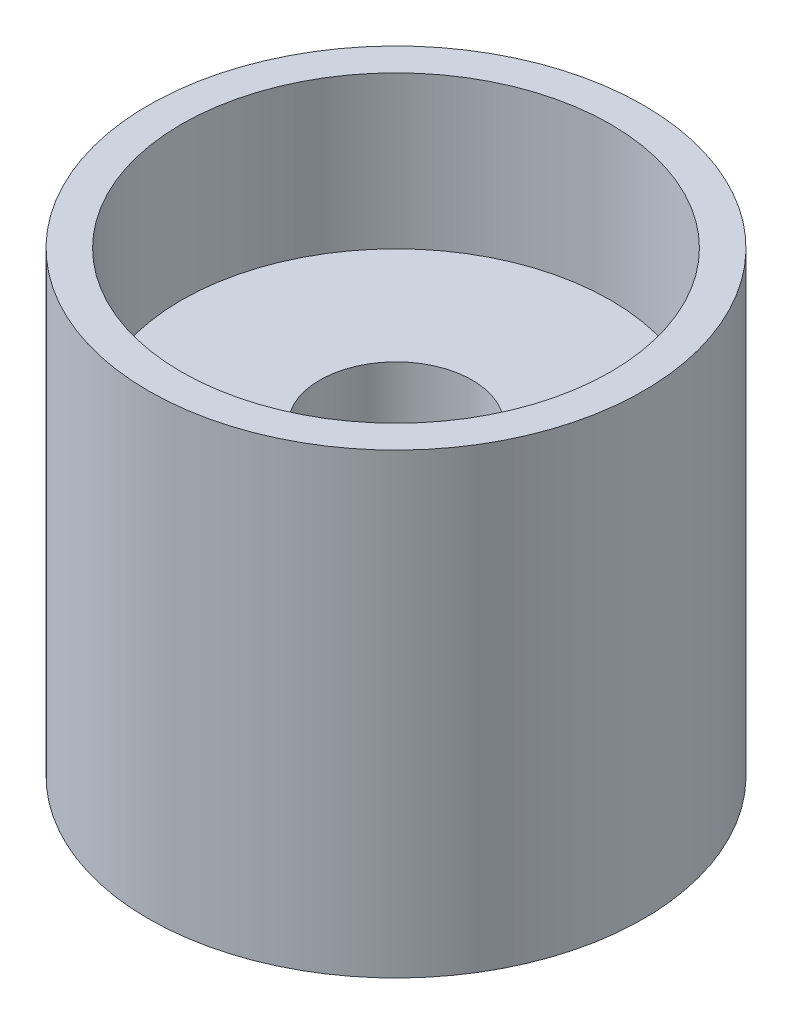
ISO-10303-21;
HEADER;
FILE_DESCRIPTION(('STEP AP214'),'2;1');
FILE_NAME('part.step','',(''),(''),'','','');
FILE_SCHEMA(('AUTOMOTIVE_DESIGN { 1 0 10303 214 1 1 1 1 }'));
ENDSEC;
DATA;
#1=APPLICATION_CONTEXT('core data for automotive mechanical design processes');
#2=APPLICATION_PROTOCOL_DEFINITION('international standard','automotive_design',2000,#1);
#3=PRODUCT_CONTEXT('',#1,'mechanical');
#4=PRODUCT('Part','Part','',(#3));
#5=PRODUCT_RELATED_PRODUCT_CATEGORY('part','',(#4));
#6=PRODUCT_DEFINITION_FORMATION('','',#4);
#7=PRODUCT_DEFINITION_CONTEXT('part definition',#1,'design');
#8=PRODUCT_DEFINITION('design','',#6,#7);
#9=PRODUCT_DEFINITION_SHAPE('','',#8);
#10=(LENGTH_UNIT() NAMED_UNIT(*) SI_UNIT(.MILLI.,.METRE.));
#11=(NAMED_UNIT(*) PLANE_ANGLE_UNIT() SI_UNIT($,.RADIAN.));
#12=(NAMED_UNIT(*) SI_UNIT($,.STERADIAN.) SOLID_ANGLE_UNIT());
#13=UNCERTAINTY_MEASURE_WITH_UNIT(LENGTH_MEASURE(1.E-05),#10,'distance_accuracy_value','');
#14=(GEOMETRIC_REPRESENTATION_CONTEXT(3) GLOBAL_UNCERTAINTY_ASSIGNED_CONTEXT((#13)) GLOBAL_UNIT_ASSIGNED_CONTEXT((#10,
#11,#12)) REPRESENTATION_CONTEXT('',''));
#15=CARTESIAN_POINT('',(0.,0.,0.));
#16=DIRECTION('',(0.,0.,1.));
#17=DIRECTION('',(1.,0.,0.));
#18=AXIS2_PLACEMENT_3D('',#15,#16,#17);
#19=CARTESIAN_POINT('',(0.,0.,0.));
#20=DIRECTION('',(0.,1.,0.));
#21=DIRECTION('',(0.,0.,1.));
#22=AXIS2_PLACEMENT_3D('',#19,#20,#21);
#23=CYLINDRICAL_SURFACE('',#22,3.175);
#24=CARTESIAN_POINT('',(0.,-6.35,0.));
#25=DIRECTION('',(0.,1.,0.));
#26=DIRECTION('',(0.,0.,1.));
#27=AXIS2_PLACEMENT_3D('',#24,#25,#26);
#28=CIRCLE('',#27,3.175);
#29=CARTESIAN_POINT('',(0.,-6.35,3.175));
#30=VERTEX_POINT('',#29);
#31=EDGE_CURVE('E10',#30,#30,#28,.T.);
#32=ORIENTED_EDGE('',*,*,#31,.T.);
#33=EDGE_LOOP('',(#32));
#34=FACE_BOUND('',#33,.T.);
#35=CARTESIAN_POINT('',(0.,-19.05,0.));
#36=DIRECTION('',(0.,1.,0.));
#37=DIRECTION('',(0.,0.,1.));
#38=AXIS2_PLACEMENT_3D('',#35,#36,#37);
#39=CIRCLE('',#38,3.175);
#40=CARTESIAN_POINT('',(0.,-19.05,3.175));
#41=VERTEX_POINT('',#40);
#42=EDGE_CURVE('E64',#41,#41,#39,.T.);
#43=ORIENTED_EDGE('',*,*,#42,.F.);
#44=EDGE_LOOP('',(#43));
#45=FACE_BOUND('',#44,.T.);
#46=ADVANCED_FACE('F37',(#34,#45),#23,.F.);
#47=CARTESIAN_POINT('',(-3.175,-6.35,0.));
#48=DIRECTION('',(0.,1.,0.));
#49=DIRECTION('',(0.,0.,1.));
#50=AXIS2_PLACEMENT_3D('',#47,#48,#49);
#51=PLANE('',#50);
#52=CARTESIAN_POINT('',(0.,-6.35,0.));
#53=DIRECTION('',(0.,1.,0.));
#54=DIRECTION('',(0.,0.,1.));
#55=AXIS2_PLACEMENT_3D('',#52,#53,#54);
#56=CIRCLE('',#55,8.9408);
#57=CARTESIAN_POINT('',(0.,-6.35,8.9408));
#58=VERTEX_POINT('',#57);
#59=EDGE_CURVE('E44',#58,#58,#56,.T.);
#60=ORIENTED_EDGE('',*,*,#59,.T.);
#61=EDGE_LOOP('',(#60));
#62=FACE_BOUND('',#61,.T.);
#63=ORIENTED_EDGE('',*,*,#31,.F.);
#64=EDGE_LOOP('',(#63));
#65=FACE_BOUND('',#64,.T.);
#66=ADVANCED_FACE('F73',(#62,#65),#51,.T.);
#67=CARTESIAN_POINT('',(0.,0.,0.));
#68=DIRECTION('',(0.,1.,0.));
#69=DIRECTION('',(0.,0.,1.));
#70=AXIS2_PLACEMENT_3D('',#67,#68,#69);
#71=CYLINDRICAL_SURFACE('',#70,8.9408);
#72=CARTESIAN_POINT('',(0.,0.,0.));
#73=DIRECTION('',(0.,1.,0.));
#74=DIRECTION('',(0.,0.,1.));
#75=AXIS2_PLACEMENT_3D('',#72,#73,#74);
#76=CIRCLE('',#75,8.9408);
#77=CARTESIAN_POINT('',(0.,0.,8.9408));
#78=VERTEX_POINT('',#77);
#79=EDGE_CURVE('E49',#78,#78,#76,.T.);
#80=ORIENTED_EDGE('',*,*,#79,.T.);
#81=EDGE_LOOP('',(#80));
#82=FACE_BOUND('',#81,.T.);
#83=ORIENTED_EDGE('',*,*,#59,.F.);
#84=EDGE_LOOP('',(#83));
#85=FACE_BOUND('',#84,.T.);
#86=ADVANCED_FACE('F77',(#82,#85),#71,.F.);
#87=CARTESIAN_POINT('',(-8.9408,0.,0.));
#88=DIRECTION('',(0.,1.,0.));
#89=DIRECTION('',(0.,0.,1.));
#90=AXIS2_PLACEMENT_3D('',#87,#88,#89);
#91=PLANE('',#90);
#92=CARTESIAN_POINT('',(0.,0.,0.));
#93=DIRECTION('',(0.,1.,0.));
#94=DIRECTION('',(0.,0.,1.));
#95=AXIS2_PLACEMENT_3D('',#92,#93,#94);
#96=CIRCLE('',#95,10.3124);
#97=CARTESIAN_POINT('',(0.,0.,10.3124));
#98=VERTEX_POINT('',#97);
#99=EDGE_CURVE('E54',#98,#98,#96,.T.);
#100=ORIENTED_EDGE('',*,*,#99,.T.);
#101=EDGE_LOOP('',(#100));
#102=FACE_BOUND('',#101,.T.);
#103=ORIENTED_EDGE('',*,*,#79,.F.);
#104=EDGE_LOOP('',(#103));
#105=FACE_BOUND('',#104,.T.);
#106=ADVANCED_FACE('F81',(#102,#105),#91,.T.);
#107=CARTESIAN_POINT('',(0.,0.,0.));
#108=DIRECTION('',(0.,1.,0.));
#109=DIRECTION('',(0.,0.,1.));
#110=AXIS2_PLACEMENT_3D('',#107,#108,#109);
#111=CYLINDRICAL_SURFACE('',#110,10.3124);
#112=CARTESIAN_POINT('',(0.,-19.05,0.));
#113=DIRECTION('',(0.,1.,0.));
#114=DIRECTION('',(0.,0.,1.));
#115=AXIS2_PLACEMENT_3D('',#112,#113,#114);
#116=CIRCLE('',#115,10.3124);
#117=CARTESIAN_POINT('',(0.,-19.05,10.3124));
#118=VERTEX_POINT('',#117);
#119=EDGE_CURVE('E60',#118,#118,#116,.T.);
#120=ORIENTED_EDGE('',*,*,#119,.T.);
#121=EDGE_LOOP('',(#120));
#122=FACE_BOUND('',#121,.T.);
#123=ORIENTED_EDGE('',*,*,#99,.F.);
#124=EDGE_LOOP('',(#123));
#125=FACE_BOUND('',#124,.T.);
#126=ADVANCED_FACE('F88',(#122,#125),#111,.T.);
#127=CARTESIAN_POINT('',(-10.3124,-19.05,0.));
#128=DIRECTION('',(0.,-1.,0.));
#129=DIRECTION('',(0.,0.,-1.));
#130=AXIS2_PLACEMENT_3D('',#127,#128,#129);
#131=PLANE('',#130);
#132=ORIENTED_EDGE('',*,*,#42,.T.);
#133=EDGE_LOOP('',(#132));
#134=FACE_BOUND('',#133,.T.);
#135=ORIENTED_EDGE('',*,*,#119,.F.);
#136=EDGE_LOOP('',(#135));
#137=FACE_BOUND('',#136,.T.);
#138=ADVANCED_FACE('F69',(#134,#137),#131,.T.);
#139=CLOSED_SHELL('',(#46,#66,#86,#106,#126,#138));
#140=MANIFOLD_SOLID_BREP('B2',#139);
#141=ADVANCED_BREP_SHAPE_REPRESENTATION('',(#18,#140),#14);
#142=SHAPE_DEFINITION_REPRESENTATION(#9,#141);
ENDSEC;
END-ISO-10303-21;
